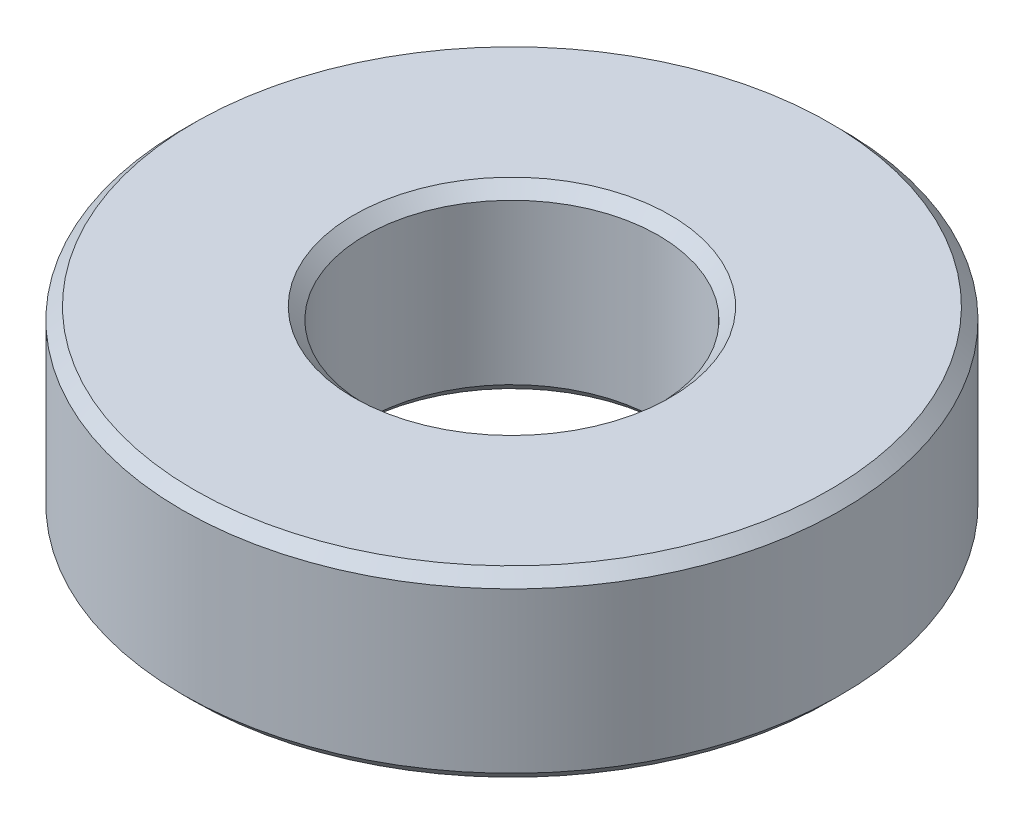
ISO-10303-21;
HEADER;
FILE_DESCRIPTION(('STEP AP214'),'2;1');
FILE_NAME('part.step','',(''),(''),'','','');
FILE_SCHEMA(('AUTOMOTIVE_DESIGN { 1 0 10303 214 1 1 1 1 }'));
ENDSEC;
DATA;
#1=APPLICATION_CONTEXT('core data for automotive mechanical design processes');
#2=APPLICATION_PROTOCOL_DEFINITION('international standard','automotive_design',2000,#1);
#3=PRODUCT_CONTEXT('',#1,'mechanical');
#4=PRODUCT('Part','Part','',(#3));
#5=PRODUCT_RELATED_PRODUCT_CATEGORY('part','',(#4));
#6=PRODUCT_DEFINITION_FORMATION('','',#4);
#7=PRODUCT_DEFINITION_CONTEXT('part definition',#1,'design');
#8=PRODUCT_DEFINITION('design','',#6,#7);
#9=PRODUCT_DEFINITION_SHAPE('','',#8);
#10=(LENGTH_UNIT() NAMED_UNIT(*) SI_UNIT(.MILLI.,.METRE.));
#11=(NAMED_UNIT(*) PLANE_ANGLE_UNIT() SI_UNIT($,.RADIAN.));
#12=(NAMED_UNIT(*) SI_UNIT($,.STERADIAN.) SOLID_ANGLE_UNIT());
#13=UNCERTAINTY_MEASURE_WITH_UNIT(LENGTH_MEASURE(1.E-05),#10,'distance_accuracy_value','');
#14=(GEOMETRIC_REPRESENTATION_CONTEXT(3) GLOBAL_UNCERTAINTY_ASSIGNED_CONTEXT((#13)) GLOBAL_UNIT_ASSIGNED_CONTEXT((#10,
#11,#12)) REPRESENTATION_CONTEXT('',''));
#15=CARTESIAN_POINT('',(0.,0.,0.));
#16=DIRECTION('',(0.,0.,1.));
#17=DIRECTION('',(1.,0.,0.));
#18=AXIS2_PLACEMENT_3D('',#15,#16,#17);
#19=CARTESIAN_POINT('',(0.,3.96875,0.));
#20=DIRECTION('',(0.,1.,0.));
#21=DIRECTION('',(0.,0.,1.));
#22=AXIS2_PLACEMENT_3D('',#19,#20,#21);
#23=PLANE('',#22);
#24=CARTESIAN_POINT('',(0.,3.96875,0.));
#25=DIRECTION('',(0.,1.,0.));
#26=DIRECTION('',(0.,0.,1.));
#27=AXIS2_PLACEMENT_3D('',#24,#25,#26);
#28=CIRCLE('',#27,6.858);
#29=CARTESIAN_POINT('',(0.,3.96875,6.858));
#30=VERTEX_POINT('',#29);
#31=EDGE_CURVE('E10',#30,#30,#28,.F.);
#32=ORIENTED_EDGE('',*,*,#31,.T.);
#33=EDGE_LOOP('',(#32));
#34=FACE_BOUND('',#33,.T.);
#35=CARTESIAN_POINT('',(0.,3.96875,0.));
#36=DIRECTION('',(0.,1.,0.));
#37=DIRECTION('',(0.,0.,1.));
#38=AXIS2_PLACEMENT_3D('',#35,#36,#37);
#39=CIRCLE('',#38,13.7795);
#40=CARTESIAN_POINT('',(0.,3.96875,13.7795));
#41=VERTEX_POINT('',#40);
#42=EDGE_CURVE('E21',#41,#41,#39,.T.);
#43=ORIENTED_EDGE('',*,*,#42,.T.);
#44=EDGE_LOOP('',(#43));
#45=FACE_BOUND('',#44,.T.);
#46=ADVANCED_FACE('F14',(#34,#45),#23,.T.);
#47=CARTESIAN_POINT('',(0.,-3.96875,0.));
#48=DIRECTION('',(0.,1.,0.));
#49=DIRECTION('',(0.,0.,1.));
#50=AXIS2_PLACEMENT_3D('',#47,#48,#49);
#51=PLANE('',#50);
#52=CARTESIAN_POINT('',(0.,-3.96875,0.));
#53=DIRECTION('',(0.,1.,0.));
#54=DIRECTION('',(0.,0.,1.));
#55=AXIS2_PLACEMENT_3D('',#52,#53,#54);
#56=CIRCLE('',#55,6.858);
#57=CARTESIAN_POINT('',(0.,-3.96875,6.858));
#58=VERTEX_POINT('',#57);
#59=EDGE_CURVE('E40',#58,#58,#56,.T.);
#60=ORIENTED_EDGE('',*,*,#59,.T.);
#61=EDGE_LOOP('',(#60));
#62=FACE_BOUND('',#61,.T.);
#63=CARTESIAN_POINT('',(0.,-3.96875,0.));
#64=DIRECTION('',(0.,1.,0.));
#65=DIRECTION('',(0.,0.,1.));
#66=AXIS2_PLACEMENT_3D('',#63,#64,#65);
#67=CIRCLE('',#66,13.7795);
#68=CARTESIAN_POINT('',(0.,-3.96875,13.7795));
#69=VERTEX_POINT('',#68);
#70=EDGE_CURVE('E43',#69,#69,#67,.F.);
#71=ORIENTED_EDGE('',*,*,#70,.T.);
#72=EDGE_LOOP('',(#71));
#73=FACE_BOUND('',#72,.T.);
#74=ADVANCED_FACE('F47',(#62,#73),#51,.F.);
#75=CARTESIAN_POINT('',(0.,3.96875,0.));
#76=DIRECTION('',(0.,-1.,0.));
#77=DIRECTION('',(0.,0.,-1.));
#78=AXIS2_PLACEMENT_3D('',#75,#76,#77);
#79=CYLINDRICAL_SURFACE('',#78,14.2875);
#80=CARTESIAN_POINT('',(0.,-3.46075,0.));
#81=DIRECTION('',(0.,1.,0.));
#82=DIRECTION('',(0.,0.,1.));
#83=AXIS2_PLACEMENT_3D('',#80,#81,#82);
#84=CIRCLE('',#83,14.2875);
#85=CARTESIAN_POINT('',(0.,-3.46075,14.2875));
#86=VERTEX_POINT('',#85);
#87=EDGE_CURVE('E25',#86,#86,#84,.T.);
#88=ORIENTED_EDGE('',*,*,#87,.T.);
#89=EDGE_LOOP('',(#88));
#90=FACE_BOUND('',#89,.T.);
#91=CARTESIAN_POINT('',(0.,3.46075,0.));
#92=DIRECTION('',(0.,1.,0.));
#93=DIRECTION('',(0.,0.,1.));
#94=AXIS2_PLACEMENT_3D('',#91,#92,#93);
#95=CIRCLE('',#94,14.2875);
#96=CARTESIAN_POINT('',(0.,3.46075,14.2875));
#97=VERTEX_POINT('',#96);
#98=EDGE_CURVE('E29',#97,#97,#95,.F.);
#99=ORIENTED_EDGE('',*,*,#98,.T.);
#100=EDGE_LOOP('',(#99));
#101=FACE_BOUND('',#100,.T.);
#102=ADVANCED_FACE('F57',(#90,#101),#79,.T.);
#103=CARTESIAN_POINT('',(0.,3.96875,0.));
#104=DIRECTION('',(0.,-1.,0.));
#105=DIRECTION('',(0.,0.,-1.));
#106=AXIS2_PLACEMENT_3D('',#103,#104,#105);
#107=CYLINDRICAL_SURFACE('',#106,6.35);
#108=CARTESIAN_POINT('',(0.,-3.46075,0.));
#109=DIRECTION('',(0.,1.,0.));
#110=DIRECTION('',(0.,0.,1.));
#111=AXIS2_PLACEMENT_3D('',#108,#109,#110);
#112=CIRCLE('',#111,6.35);
#113=CARTESIAN_POINT('',(0.,-3.46075,6.35));
#114=VERTEX_POINT('',#113);
#115=EDGE_CURVE('E34',#114,#114,#112,.F.);
#116=ORIENTED_EDGE('',*,*,#115,.T.);
#117=EDGE_LOOP('',(#116));
#118=FACE_BOUND('',#117,.T.);
#119=CARTESIAN_POINT('',(0.,3.46075,0.));
#120=DIRECTION('',(0.,1.,0.));
#121=DIRECTION('',(0.,0.,1.));
#122=AXIS2_PLACEMENT_3D('',#119,#120,#121);
#123=CIRCLE('',#122,6.35);
#124=CARTESIAN_POINT('',(0.,3.46075,6.35));
#125=VERTEX_POINT('',#124);
#126=EDGE_CURVE('E37',#125,#125,#123,.T.);
#127=ORIENTED_EDGE('',*,*,#126,.T.);
#128=EDGE_LOOP('',(#127));
#129=FACE_BOUND('',#128,.T.);
#130=ADVANCED_FACE('F60',(#118,#129),#107,.F.);
#131=CARTESIAN_POINT('',(0.,-3.96875,0.));
#132=DIRECTION('',(0.,-1.,0.));
#133=DIRECTION('',(0.,0.,-1.));
#134=AXIS2_PLACEMENT_3D('',#131,#132,#133);
#135=CONICAL_SURFACE('',#134,6.858,0.785398163397446);
#136=ORIENTED_EDGE('',*,*,#115,.F.);
#137=EDGE_LOOP('',(#136));
#138=FACE_BOUND('',#137,.T.);
#139=ORIENTED_EDGE('',*,*,#59,.F.);
#140=EDGE_LOOP('',(#139));
#141=FACE_BOUND('',#140,.T.);
#142=ADVANCED_FACE('F53',(#138,#141),#135,.F.);
#143=CARTESIAN_POINT('',(0.,-3.46075,0.));
#144=DIRECTION('',(0.,1.,0.));
#145=DIRECTION('',(0.,0.,1.));
#146=AXIS2_PLACEMENT_3D('',#143,#144,#145);
#147=CONICAL_SURFACE('',#146,14.2875,0.78539816339745);
#148=ORIENTED_EDGE('',*,*,#70,.F.);
#149=EDGE_LOOP('',(#148));
#150=FACE_BOUND('',#149,.T.);
#151=ORIENTED_EDGE('',*,*,#87,.F.);
#152=EDGE_LOOP('',(#151));
#153=FACE_BOUND('',#152,.T.);
#154=ADVANCED_FACE('F49',(#150,#153),#147,.T.);
#155=CARTESIAN_POINT('',(0.,3.46075,0.));
#156=DIRECTION('',(0.,1.,0.));
#157=DIRECTION('',(0.,0.,1.));
#158=AXIS2_PLACEMENT_3D('',#155,#156,#157);
#159=CONICAL_SURFACE('',#158,6.35,0.78539816339745);
#160=ORIENTED_EDGE('',*,*,#31,.F.);
#161=EDGE_LOOP('',(#160));
#162=FACE_BOUND('',#161,.T.);
#163=ORIENTED_EDGE('',*,*,#126,.F.);
#164=EDGE_LOOP('',(#163));
#165=FACE_BOUND('',#164,.T.);
#166=ADVANCED_FACE('F52',(#162,#165),#159,.F.);
#167=CARTESIAN_POINT('',(0.,3.96875,0.));
#168=DIRECTION('',(0.,-1.,0.));
#169=DIRECTION('',(0.,0.,-1.));
#170=AXIS2_PLACEMENT_3D('',#167,#168,#169);
#171=CONICAL_SURFACE('',#170,13.7795,0.785398163397442);
#172=ORIENTED_EDGE('',*,*,#98,.F.);
#173=EDGE_LOOP('',(#172));
#174=FACE_BOUND('',#173,.T.);
#175=ORIENTED_EDGE('',*,*,#42,.F.);
#176=EDGE_LOOP('',(#175));
#177=FACE_BOUND('',#176,.T.);
#178=ADVANCED_FACE('F16',(#174,#177),#171,.T.);
#179=CLOSED_SHELL('',(#46,#74,#102,#130,#142,#154,#166,#178));
#180=MANIFOLD_SOLID_BREP('B1',#179);
#181=ADVANCED_BREP_SHAPE_REPRESENTATION('',(#18,#180),#14);
#182=SHAPE_DEFINITION_REPRESENTATION(#9,#181);
ENDSEC;
END-ISO-10303-21;
